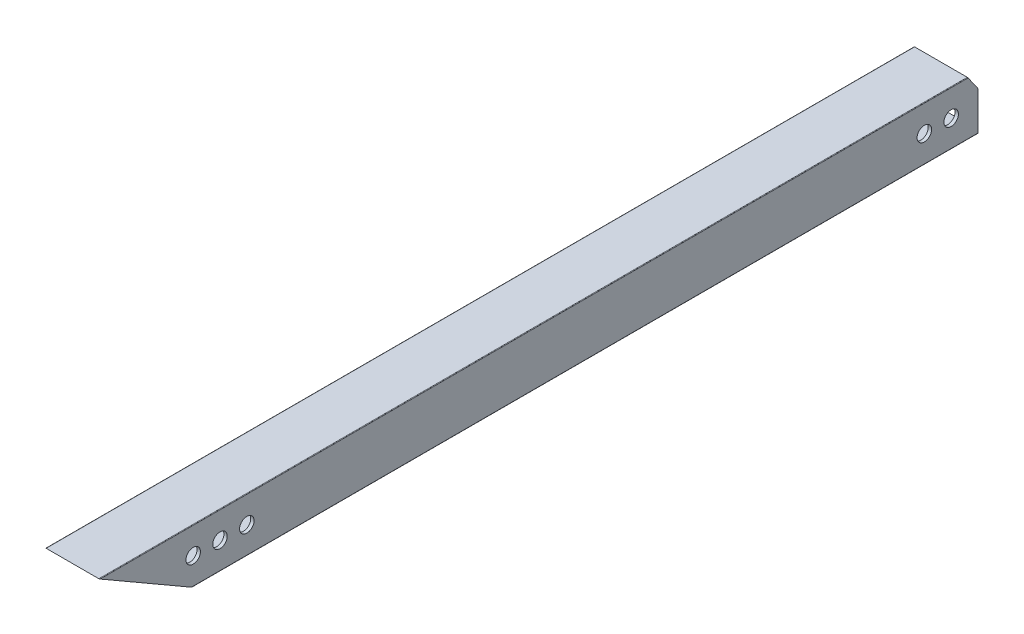
ISO-10303-21;
HEADER;
FILE_DESCRIPTION(('STEP AP214'),'2;1');
FILE_NAME('part.step','',(''),(''),'','','');
FILE_SCHEMA(('AUTOMOTIVE_DESIGN { 1 0 10303 214 1 1 1 1 }'));
ENDSEC;
DATA;
#1=APPLICATION_CONTEXT('core data for automotive mechanical design processes');
#2=APPLICATION_PROTOCOL_DEFINITION('international standard','automotive_design',2000,#1);
#3=PRODUCT_CONTEXT('',#1,'mechanical');
#4=PRODUCT('Part','Part','',(#3));
#5=PRODUCT_RELATED_PRODUCT_CATEGORY('part','',(#4));
#6=PRODUCT_DEFINITION_FORMATION('','',#4);
#7=PRODUCT_DEFINITION_CONTEXT('part definition',#1,'design');
#8=PRODUCT_DEFINITION('design','',#6,#7);
#9=PRODUCT_DEFINITION_SHAPE('','',#8);
#10=(LENGTH_UNIT() NAMED_UNIT(*) SI_UNIT(.MILLI.,.METRE.));
#11=(NAMED_UNIT(*) PLANE_ANGLE_UNIT() SI_UNIT($,.RADIAN.));
#12=(NAMED_UNIT(*) SI_UNIT($,.STERADIAN.) SOLID_ANGLE_UNIT());
#13=UNCERTAINTY_MEASURE_WITH_UNIT(LENGTH_MEASURE(1.E-05),#10,'distance_accuracy_value','');
#14=(GEOMETRIC_REPRESENTATION_CONTEXT(3) GLOBAL_UNCERTAINTY_ASSIGNED_CONTEXT((#13)) GLOBAL_UNIT_ASSIGNED_CONTEXT((#10,
#11,#12)) REPRESENTATION_CONTEXT('',''));
#15=CARTESIAN_POINT('',(0.,0.,0.));
#16=DIRECTION('',(0.,0.,1.));
#17=DIRECTION('',(1.,0.,0.));
#18=AXIS2_PLACEMENT_3D('',#15,#16,#17);
#19=CARTESIAN_POINT('',(-12.446,-12.446,0.));
#20=DIRECTION('',(0.,0.,-1.));
#21=DIRECTION('',(-1.,0.,0.));
#22=AXIS2_PLACEMENT_3D('',#19,#20,#21);
#23=PLANE('',#22);
#24=DIRECTION('',(-1.,0.,0.));
#25=VECTOR('',#24,1.);
#26=CARTESIAN_POINT('',(12.7,5.78069552987882,0.));
#27=LINE('',#26,#25);
#28=CARTESIAN_POINT('',(12.7,5.78069552987882,0.));
#29=VERTEX_POINT('',#28);
#30=CARTESIAN_POINT('',(11.1125,5.78069552987882,0.));
#31=VERTEX_POINT('',#30);
#32=EDGE_CURVE('E180',#29,#31,#27,.T.);
#33=ORIENTED_EDGE('',*,*,#32,.F.);
#34=DIRECTION('',(0.,1.,0.));
#35=VECTOR('',#34,1.);
#36=CARTESIAN_POINT('',(12.7,-12.446,0.));
#37=LINE('',#36,#35);
#38=CARTESIAN_POINT('',(12.7,-12.446,0.));
#39=VERTEX_POINT('',#38);
#40=EDGE_CURVE('E202',#39,#29,#37,.T.);
#41=ORIENTED_EDGE('',*,*,#40,.F.);
#42=CARTESIAN_POINT('',(12.446,-12.446,0.));
#43=DIRECTION('',(0.,0.,1.));
#44=DIRECTION('',(1.,0.,0.));
#45=AXIS2_PLACEMENT_3D('',#42,#43,#44);
#46=CIRCLE('',#45,0.254000000000001);
#47=CARTESIAN_POINT('',(12.446,-12.7,0.));
#48=VERTEX_POINT('',#47);
#49=EDGE_CURVE('E209',#48,#39,#46,.T.);
#50=ORIENTED_EDGE('',*,*,#49,.F.);
#51=DIRECTION('',(1.,0.,0.));
#52=VECTOR('',#51,1.);
#53=CARTESIAN_POINT('',(-12.446,-12.7,0.));
#54=LINE('',#53,#52);
#55=CARTESIAN_POINT('',(-12.446,-12.7,0.));
#56=VERTEX_POINT('',#55);
#57=EDGE_CURVE('E326',#56,#48,#54,.T.);
#58=ORIENTED_EDGE('',*,*,#57,.F.);
#59=CARTESIAN_POINT('',(-12.446,-12.446,0.));
#60=DIRECTION('',(0.,0.,1.));
#61=DIRECTION('',(-1.,0.,0.));
#62=AXIS2_PLACEMENT_3D('',#59,#60,#61);
#63=CIRCLE('',#62,0.254000000000001);
#64=CARTESIAN_POINT('',(-12.7,-12.446,0.));
#65=VERTEX_POINT('',#64);
#66=EDGE_CURVE('E199',#65,#56,#63,.T.);
#67=ORIENTED_EDGE('',*,*,#66,.F.);
#68=DIRECTION('',(0.,-1.,0.));
#69=VECTOR('',#68,1.);
#70=CARTESIAN_POINT('',(-12.7,-12.446,0.));
#71=LINE('',#70,#69);
#72=CARTESIAN_POINT('',(-12.7,5.78069552987882,0.));
#73=VERTEX_POINT('',#72);
#74=EDGE_CURVE('E188',#73,#65,#71,.T.);
#75=ORIENTED_EDGE('',*,*,#74,.F.);
#76=CARTESIAN_POINT('',(-11.1125,5.78069552987882,0.));
#77=VERTEX_POINT('',#76);
#78=EDGE_CURVE('E169',#77,#73,#27,.T.);
#79=ORIENTED_EDGE('',*,*,#78,.F.);
#80=DIRECTION('',(0.,-1.,0.));
#81=VECTOR('',#80,1.);
#82=CARTESIAN_POINT('',(-11.1125,-9.58849999999999,0.));
#83=LINE('',#82,#81);
#84=CARTESIAN_POINT('',(-11.1125,-9.58849999999999,0.));
#85=VERTEX_POINT('',#84);
#86=EDGE_CURVE('E293',#77,#85,#83,.T.);
#87=ORIENTED_EDGE('',*,*,#86,.T.);
#88=CARTESIAN_POINT('',(-9.5885,-9.5885,0.));
#89=DIRECTION('',(0.,0.,1.));
#90=DIRECTION('',(1.,0.,0.));
#91=AXIS2_PLACEMENT_3D('',#88,#89,#90);
#92=CIRCLE('',#91,1.524);
#93=CARTESIAN_POINT('',(-9.58849999999999,-11.1125,0.));
#94=VERTEX_POINT('',#93);
#95=EDGE_CURVE('E277',#85,#94,#92,.T.);
#96=ORIENTED_EDGE('',*,*,#95,.T.);
#97=DIRECTION('',(1.,0.,0.));
#98=VECTOR('',#97,1.);
#99=CARTESIAN_POINT('',(-9.58849999999999,-11.1125,0.));
#100=LINE('',#99,#98);
#101=CARTESIAN_POINT('',(9.58849999999999,-11.1125,0.));
#102=VERTEX_POINT('',#101);
#103=EDGE_CURVE('E281',#94,#102,#100,.T.);
#104=ORIENTED_EDGE('',*,*,#103,.T.);
#105=CARTESIAN_POINT('',(9.5885,-9.5885,0.));
#106=DIRECTION('',(0.,0.,1.));
#107=DIRECTION('',(-1.,0.,0.));
#108=AXIS2_PLACEMENT_3D('',#105,#106,#107);
#109=CIRCLE('',#108,1.524);
#110=CARTESIAN_POINT('',(11.1125,-9.58849999999999,0.));
#111=VERTEX_POINT('',#110);
#112=EDGE_CURVE('E285',#102,#111,#109,.T.);
#113=ORIENTED_EDGE('',*,*,#112,.T.);
#114=DIRECTION('',(0.,1.,0.));
#115=VECTOR('',#114,1.);
#116=CARTESIAN_POINT('',(11.1125,-9.58849999999999,0.));
#117=LINE('',#116,#115);
#118=EDGE_CURVE('E289',#111,#31,#117,.T.);
#119=ORIENTED_EDGE('',*,*,#118,.T.);
#120=EDGE_LOOP('',(#33,#41,#50,#58,#67,#75,#79,#87,#96,#104,#113,#119));
#121=FACE_BOUND('',#120,.T.);
#122=ADVANCED_FACE('F43',(#121),#23,.T.);
#123=CARTESIAN_POINT('',(-12.446,-12.446,415.925));
#124=DIRECTION('',(0.,0.,-1.));
#125=DIRECTION('',(-1.,0.,0.));
#126=AXIS2_PLACEMENT_3D('',#123,#124,#125);
#127=CYLINDRICAL_SURFACE('',#126,0.254000000000001);
#128=DIRECTION('',(0.,0.,-1.));
#129=VECTOR('',#128,1.);
#130=CARTESIAN_POINT('',(-12.446,-12.7,415.925));
#131=LINE('',#130,#129);
#132=CARTESIAN_POINT('',(-12.446,-12.7,371.930909487751));
#133=VERTEX_POINT('',#132);
#134=EDGE_CURVE('E235',#133,#56,#131,.T.);
#135=ORIENTED_EDGE('',*,*,#134,.F.);
#136=CARTESIAN_POINT('',(-12.446,-12.446,372.370850392873));
#137=DIRECTION('',(0.,0.866025403784438,-0.500000000000001));
#138=DIRECTION('',(0.,-0.500000000000001,-0.866025403784438));
#139=AXIS2_PLACEMENT_3D('',#136,#137,#138);
#140=ELLIPSE('',#139,0.508000000000001,0.254000000000001);
#141=CARTESIAN_POINT('',(-12.7,-12.446,372.370850392873));
#142=VERTEX_POINT('',#141);
#143=EDGE_CURVE('E244',#133,#142,#140,.T.);
#144=ORIENTED_EDGE('',*,*,#143,.T.);
#145=DIRECTION('',(0.,0.,-1.));
#146=VECTOR('',#145,1.);
#147=CARTESIAN_POINT('',(-12.7,-12.446,415.925));
#148=LINE('',#147,#146);
#149=EDGE_CURVE('E206',#142,#65,#148,.T.);
#150=ORIENTED_EDGE('',*,*,#149,.T.);
#151=ORIENTED_EDGE('',*,*,#66,.T.);
#152=EDGE_LOOP('',(#135,#144,#150,#151));
#153=FACE_BOUND('',#152,.T.);
#154=ADVANCED_FACE('F45',(#153),#127,.T.);
#155=CARTESIAN_POINT('',(-12.446,-12.7,415.925));
#156=DIRECTION('',(0.,1.,0.));
#157=DIRECTION('',(0.,0.,1.));
#158=AXIS2_PLACEMENT_3D('',#155,#156,#157);
#159=PLANE('',#158);
#160=DIRECTION('',(0.,0.,-1.));
#161=VECTOR('',#160,1.);
#162=CARTESIAN_POINT('',(12.446,-12.7,415.925));
#163=LINE('',#162,#161);
#164=CARTESIAN_POINT('',(12.446,-12.7,371.930909487751));
#165=VERTEX_POINT('',#164);
#166=EDGE_CURVE('E232',#165,#48,#163,.T.);
#167=ORIENTED_EDGE('',*,*,#166,.F.);
#168=DIRECTION('',(-1.,0.,0.));
#169=VECTOR('',#168,1.);
#170=CARTESIAN_POINT('',(12.7,-12.7,371.930909487751));
#171=LINE('',#170,#169);
#172=EDGE_CURVE('E346',#165,#133,#171,.T.);
#173=ORIENTED_EDGE('',*,*,#172,.T.);
#174=ORIENTED_EDGE('',*,*,#134,.T.);
#175=ORIENTED_EDGE('',*,*,#57,.T.);
#176=EDGE_LOOP('',(#167,#173,#174,#175));
#177=FACE_BOUND('',#176,.T.);
#178=ADVANCED_FACE('F492',(#177),#159,.F.);
#179=CARTESIAN_POINT('',(12.446,-12.446,415.925));
#180=DIRECTION('',(0.,0.,-1.));
#181=DIRECTION('',(-1.,0.,0.));
#182=AXIS2_PLACEMENT_3D('',#179,#180,#181);
#183=CYLINDRICAL_SURFACE('',#182,0.254000000000001);
#184=DIRECTION('',(0.,0.,-1.));
#185=VECTOR('',#184,1.);
#186=CARTESIAN_POINT('',(12.7,-12.446,415.925));
#187=LINE('',#186,#185);
#188=CARTESIAN_POINT('',(12.7,-12.446,372.370850392873));
#189=VERTEX_POINT('',#188);
#190=EDGE_CURVE('E229',#189,#39,#187,.T.);
#191=ORIENTED_EDGE('',*,*,#190,.F.);
#192=CARTESIAN_POINT('',(12.446,-12.446,372.370850392873));
#193=DIRECTION('',(0.,0.866025403784438,-0.500000000000001));
#194=DIRECTION('',(0.,-0.500000000000001,-0.866025403784438));
#195=AXIS2_PLACEMENT_3D('',#192,#193,#194);
#196=ELLIPSE('',#195,0.508000000000001,0.254000000000001);
#197=EDGE_CURVE('E383',#189,#165,#196,.T.);
#198=ORIENTED_EDGE('',*,*,#197,.T.);
#199=ORIENTED_EDGE('',*,*,#166,.T.);
#200=ORIENTED_EDGE('',*,*,#49,.T.);
#201=EDGE_LOOP('',(#191,#198,#199,#200));
#202=FACE_BOUND('',#201,.T.);
#203=ADVANCED_FACE('F335',(#202),#183,.T.);
#204=CARTESIAN_POINT('',(12.7,-12.446,415.925));
#205=DIRECTION('',(-1.,0.,0.));
#206=DIRECTION('',(0.,0.,1.));
#207=AXIS2_PLACEMENT_3D('',#204,#205,#206);
#208=PLANE('',#207);
#209=CARTESIAN_POINT('',(12.7,0.,371.475));
#210=DIRECTION('',(-1.,0.,0.));
#211=DIRECTION('',(0.,0.,1.));
#212=AXIS2_PLACEMENT_3D('',#209,#210,#211);
#213=CIRCLE('',#212,3.429);
#214=CARTESIAN_POINT('',(12.7,0.,374.904));
#215=VERTEX_POINT('',#214);
#216=EDGE_CURVE('E435',#215,#215,#213,.T.);
#217=ORIENTED_EDGE('',*,*,#216,.T.);
#218=EDGE_LOOP('',(#217));
#219=FACE_BOUND('',#218,.T.);
#220=CARTESIAN_POINT('',(12.7,0.,358.775));
#221=DIRECTION('',(-1.,0.,0.));
#222=DIRECTION('',(0.,0.,1.));
#223=AXIS2_PLACEMENT_3D('',#220,#221,#222);
#224=CIRCLE('',#223,3.429);
#225=CARTESIAN_POINT('',(12.7,0.,362.204));
#226=VERTEX_POINT('',#225);
#227=EDGE_CURVE('E443',#226,#226,#224,.T.);
#228=ORIENTED_EDGE('',*,*,#227,.T.);
#229=EDGE_LOOP('',(#228));
#230=FACE_BOUND('',#229,.T.);
#231=CARTESIAN_POINT('',(12.7,-1.82571422441161E-13,346.075));
#232=DIRECTION('',(-1.,0.,0.));
#233=DIRECTION('',(0.,0.,1.));
#234=AXIS2_PLACEMENT_3D('',#231,#232,#233);
#235=CIRCLE('',#234,3.429);
#236=CARTESIAN_POINT('',(12.7,-1.82571422441161E-13,349.504));
#237=VERTEX_POINT('',#236);
#238=EDGE_CURVE('E451',#237,#237,#235,.T.);
#239=ORIENTED_EDGE('',*,*,#238,.T.);
#240=EDGE_LOOP('',(#239));
#241=FACE_BOUND('',#240,.T.);
#242=CARTESIAN_POINT('',(12.7,0.,12.7));
#243=DIRECTION('',(-1.,0.,0.));
#244=DIRECTION('',(0.,0.,1.));
#245=AXIS2_PLACEMENT_3D('',#242,#243,#244);
#246=CIRCLE('',#245,3.429);
#247=CARTESIAN_POINT('',(12.7,0.,16.129));
#248=VERTEX_POINT('',#247);
#249=EDGE_CURVE('E193',#248,#248,#246,.T.);
#250=ORIENTED_EDGE('',*,*,#249,.T.);
#251=EDGE_LOOP('',(#250));
#252=FACE_BOUND('',#251,.T.);
#253=CARTESIAN_POINT('',(12.7,0.,25.4));
#254=DIRECTION('',(-1.,0.,0.));
#255=DIRECTION('',(0.,0.,1.));
#256=AXIS2_PLACEMENT_3D('',#253,#254,#255);
#257=CIRCLE('',#256,3.429);
#258=CARTESIAN_POINT('',(12.7,0.,28.829));
#259=VERTEX_POINT('',#258);
#260=EDGE_CURVE('E424',#259,#259,#257,.T.);
#261=ORIENTED_EDGE('',*,*,#260,.T.);
#262=EDGE_LOOP('',(#261));
#263=FACE_BOUND('',#262,.T.);
#264=ORIENTED_EDGE('',*,*,#40,.T.);
#265=DIRECTION('',(0.,0.819152044288984,0.573576436351057));
#266=VECTOR('',#265,1.);
#267=CARTESIAN_POINT('',(12.7,5.78069552987882,0.));
#268=LINE('',#267,#266);
#269=CARTESIAN_POINT('',(12.7,12.4460000000001,4.66709643444197));
#270=VERTEX_POINT('',#269);
#271=EDGE_CURVE('E194',#29,#270,#268,.T.);
#272=ORIENTED_EDGE('',*,*,#271,.T.);
#273=DIRECTION('',(0.,0.,-1.));
#274=VECTOR('',#273,1.);
#275=CARTESIAN_POINT('',(12.7,12.446,415.925));
#276=LINE('',#275,#274);
#277=CARTESIAN_POINT('',(12.7,12.446,415.485059094877));
#278=VERTEX_POINT('',#277);
#279=EDGE_CURVE('E225',#278,#270,#276,.T.);
#280=ORIENTED_EDGE('',*,*,#279,.F.);
#281=DIRECTION('',(0.,-0.500000000000001,-0.866025403784438));
#282=VECTOR('',#281,1.);
#283=CARTESIAN_POINT('',(12.7,12.7,415.925));
#284=LINE('',#283,#282);
#285=EDGE_CURVE('E343',#278,#189,#284,.T.);
#286=ORIENTED_EDGE('',*,*,#285,.T.);
#287=ORIENTED_EDGE('',*,*,#190,.T.);
#288=EDGE_LOOP('',(#264,#272,#280,#286,#287));
#289=FACE_BOUND('',#288,.T.);
#290=ADVANCED_FACE('F340',(#219,#230,#241,#252,#263,#289),#208,.F.);
#291=CARTESIAN_POINT('',(12.446,12.446,415.925));
#292=DIRECTION('',(0.,0.,-1.));
#293=DIRECTION('',(-1.,0.,0.));
#294=AXIS2_PLACEMENT_3D('',#291,#292,#293);
#295=CYLINDRICAL_SURFACE('',#294,0.254000000000001);
#296=ORIENTED_EDGE('',*,*,#279,.T.);
#297=CARTESIAN_POINT('',(12.446,12.446,4.66709643444185));
#298=DIRECTION('',(0.,-0.573576436351057,0.819152044288984));
#299=DIRECTION('',(0.,-0.819152044288984,-0.573576436351057));
#300=AXIS2_PLACEMENT_3D('',#297,#298,#299);
#301=ELLIPSE('',#300,0.310076745545414,0.254000000000001);
#302=CARTESIAN_POINT('',(12.446,12.7,4.84494914914713));
#303=VERTEX_POINT('',#302);
#304=EDGE_CURVE('E251',#270,#303,#301,.T.);
#305=ORIENTED_EDGE('',*,*,#304,.T.);
#306=DIRECTION('',(0.,0.,-1.));
#307=VECTOR('',#306,1.);
#308=CARTESIAN_POINT('',(12.446,12.7,415.925));
#309=LINE('',#308,#307);
#310=CARTESIAN_POINT('',(12.446,12.7,415.925));
#311=VERTEX_POINT('',#310);
#312=EDGE_CURVE('E221',#311,#303,#309,.T.);
#313=ORIENTED_EDGE('',*,*,#312,.F.);
#314=CARTESIAN_POINT('',(12.446,12.446,415.485059094877));
#315=DIRECTION('',(0.,0.866025403784438,-0.500000000000001));
#316=DIRECTION('',(0.,-0.500000000000001,-0.866025403784438));
#317=AXIS2_PLACEMENT_3D('',#314,#315,#316);
#318=ELLIPSE('',#317,0.508000000000001,0.254000000000001);
#319=EDGE_CURVE('E380',#311,#278,#318,.T.);
#320=ORIENTED_EDGE('',*,*,#319,.T.);
#321=EDGE_LOOP('',(#296,#305,#313,#320));
#322=FACE_BOUND('',#321,.T.);
#323=ADVANCED_FACE('F410',(#322),#295,.T.);
#324=CARTESIAN_POINT('',(-12.446,12.7,415.925));
#325=DIRECTION('',(0.,-1.,0.));
#326=DIRECTION('',(0.,0.,-1.));
#327=AXIS2_PLACEMENT_3D('',#324,#325,#326);
#328=PLANE('',#327);
#329=ORIENTED_EDGE('',*,*,#312,.T.);
#330=DIRECTION('',(-1.,0.,0.));
#331=VECTOR('',#330,1.);
#332=CARTESIAN_POINT('',(12.7,12.7,4.84494914914713));
#333=LINE('',#332,#331);
#334=CARTESIAN_POINT('',(-12.446,12.7,4.84494914914712));
#335=VERTEX_POINT('',#334);
#336=EDGE_CURVE('E181',#303,#335,#333,.T.);
#337=ORIENTED_EDGE('',*,*,#336,.T.);
#338=DIRECTION('',(0.,0.,-1.));
#339=VECTOR('',#338,1.);
#340=CARTESIAN_POINT('',(-12.446,12.7,415.925));
#341=LINE('',#340,#339);
#342=CARTESIAN_POINT('',(-12.446,12.7,415.925));
#343=VERTEX_POINT('',#342);
#344=EDGE_CURVE('E217',#343,#335,#341,.T.);
#345=ORIENTED_EDGE('',*,*,#344,.F.);
#346=DIRECTION('',(-1.,0.,0.));
#347=VECTOR('',#346,1.);
#348=CARTESIAN_POINT('',(-12.446,12.7,415.925));
#349=LINE('',#348,#347);
#350=EDGE_CURVE('E201',#311,#343,#349,.T.);
#351=ORIENTED_EDGE('',*,*,#350,.F.);
#352=EDGE_LOOP('',(#329,#337,#345,#351));
#353=FACE_BOUND('',#352,.T.);
#354=ADVANCED_FACE('F414',(#353),#328,.F.);
#355=CARTESIAN_POINT('',(-12.446,12.446,415.925));
#356=DIRECTION('',(0.,0.,-1.));
#357=DIRECTION('',(-1.,0.,0.));
#358=AXIS2_PLACEMENT_3D('',#355,#356,#357);
#359=CYLINDRICAL_SURFACE('',#358,0.254000000000001);
#360=ORIENTED_EDGE('',*,*,#344,.T.);
#361=CARTESIAN_POINT('',(-12.446,12.446,4.66709643444185));
#362=DIRECTION('',(0.,-0.573576436351057,0.819152044288984));
#363=DIRECTION('',(0.,-0.819152044288984,-0.573576436351057));
#364=AXIS2_PLACEMENT_3D('',#361,#362,#363);
#365=ELLIPSE('',#364,0.310076745545414,0.254000000000001);
#366=CARTESIAN_POINT('',(-12.7,12.446,4.66709643444187));
#367=VERTEX_POINT('',#366);
#368=EDGE_CURVE('E404',#335,#367,#365,.T.);
#369=ORIENTED_EDGE('',*,*,#368,.T.);
#370=DIRECTION('',(0.,0.,-1.));
#371=VECTOR('',#370,1.);
#372=CARTESIAN_POINT('',(-12.7,12.446,415.925));
#373=LINE('',#372,#371);
#374=CARTESIAN_POINT('',(-12.7,12.446,415.485059094877));
#375=VERTEX_POINT('',#374);
#376=EDGE_CURVE('E191',#375,#367,#373,.T.);
#377=ORIENTED_EDGE('',*,*,#376,.F.);
#378=CARTESIAN_POINT('',(-12.446,12.446,415.485059094877));
#379=DIRECTION('',(0.,0.866025403784438,-0.500000000000001));
#380=DIRECTION('',(0.,-0.500000000000001,-0.866025403784438));
#381=AXIS2_PLACEMENT_3D('',#378,#379,#380);
#382=ELLIPSE('',#381,0.508000000000001,0.254000000000001);
#383=EDGE_CURVE('E61',#375,#343,#382,.T.);
#384=ORIENTED_EDGE('',*,*,#383,.T.);
#385=EDGE_LOOP('',(#360,#369,#377,#384));
#386=FACE_BOUND('',#385,.T.);
#387=ADVANCED_FACE('F418',(#386),#359,.T.);
#388=CARTESIAN_POINT('',(-12.7,-12.446,415.925));
#389=DIRECTION('',(1.,0.,0.));
#390=DIRECTION('',(0.,0.,-1.));
#391=AXIS2_PLACEMENT_3D('',#388,#389,#390);
#392=PLANE('',#391);
#393=CARTESIAN_POINT('',(-12.7,0.,371.475));
#394=DIRECTION('',(-1.,0.,0.));
#395=DIRECTION('',(0.,0.,1.));
#396=AXIS2_PLACEMENT_3D('',#393,#394,#395);
#397=CIRCLE('',#396,3.429);
#398=CARTESIAN_POINT('',(-12.7,0.,374.904));
#399=VERTEX_POINT('',#398);
#400=EDGE_CURVE('E354',#399,#399,#397,.T.);
#401=ORIENTED_EDGE('',*,*,#400,.F.);
#402=EDGE_LOOP('',(#401));
#403=FACE_BOUND('',#402,.T.);
#404=CARTESIAN_POINT('',(-12.7,0.,358.775));
#405=DIRECTION('',(-1.,0.,0.));
#406=DIRECTION('',(0.,0.,1.));
#407=AXIS2_PLACEMENT_3D('',#404,#405,#406);
#408=CIRCLE('',#407,3.429);
#409=CARTESIAN_POINT('',(-12.7,0.,362.204));
#410=VERTEX_POINT('',#409);
#411=EDGE_CURVE('E439',#410,#410,#408,.T.);
#412=ORIENTED_EDGE('',*,*,#411,.F.);
#413=EDGE_LOOP('',(#412));
#414=FACE_BOUND('',#413,.T.);
#415=CARTESIAN_POINT('',(-12.7,-1.82571422441161E-13,346.075));
#416=DIRECTION('',(-1.,0.,0.));
#417=DIRECTION('',(0.,0.,1.));
#418=AXIS2_PLACEMENT_3D('',#415,#416,#417);
#419=CIRCLE('',#418,3.429);
#420=CARTESIAN_POINT('',(-12.7,-1.82571422441161E-13,349.504));
#421=VERTEX_POINT('',#420);
#422=EDGE_CURVE('E447',#421,#421,#419,.T.);
#423=ORIENTED_EDGE('',*,*,#422,.F.);
#424=EDGE_LOOP('',(#423));
#425=FACE_BOUND('',#424,.T.);
#426=CARTESIAN_POINT('',(-12.7,0.,12.7));
#427=DIRECTION('',(-1.,0.,0.));
#428=DIRECTION('',(0.,0.,1.));
#429=AXIS2_PLACEMENT_3D('',#426,#427,#428);
#430=CIRCLE('',#429,3.429);
#431=CARTESIAN_POINT('',(-12.7,0.,16.129));
#432=VERTEX_POINT('',#431);
#433=EDGE_CURVE('E454',#432,#432,#430,.T.);
#434=ORIENTED_EDGE('',*,*,#433,.F.);
#435=EDGE_LOOP('',(#434));
#436=FACE_BOUND('',#435,.T.);
#437=CARTESIAN_POINT('',(-12.7,0.,25.4));
#438=DIRECTION('',(-1.,0.,0.));
#439=DIRECTION('',(0.,0.,1.));
#440=AXIS2_PLACEMENT_3D('',#437,#438,#439);
#441=CIRCLE('',#440,3.429);
#442=CARTESIAN_POINT('',(-12.7,0.,28.829));
#443=VERTEX_POINT('',#442);
#444=EDGE_CURVE('E420',#443,#443,#441,.T.);
#445=ORIENTED_EDGE('',*,*,#444,.F.);
#446=EDGE_LOOP('',(#445));
#447=FACE_BOUND('',#446,.T.);
#448=ORIENTED_EDGE('',*,*,#376,.T.);
#449=DIRECTION('',(0.,0.819152044288984,0.573576436351057));
#450=VECTOR('',#449,1.);
#451=CARTESIAN_POINT('',(-12.7,5.78069552987882,0.));
#452=LINE('',#451,#450);
#453=EDGE_CURVE('E172',#73,#367,#452,.T.);
#454=ORIENTED_EDGE('',*,*,#453,.F.);
#455=ORIENTED_EDGE('',*,*,#74,.T.);
#456=ORIENTED_EDGE('',*,*,#149,.F.);
#457=DIRECTION('',(0.,-0.500000000000001,-0.866025403784438));
#458=VECTOR('',#457,1.);
#459=CARTESIAN_POINT('',(-12.7,12.7,415.925));
#460=LINE('',#459,#458);
#461=EDGE_CURVE('E347',#375,#142,#460,.T.);
#462=ORIENTED_EDGE('',*,*,#461,.F.);
#463=EDGE_LOOP('',(#448,#454,#455,#456,#462));
#464=FACE_BOUND('',#463,.T.);
#465=ADVANCED_FACE('F186',(#403,#414,#425,#436,#447,#464),#392,.F.);
#466=CARTESIAN_POINT('',(-9.5885,-9.5885,415.925));
#467=DIRECTION('',(0.,0.,-1.));
#468=DIRECTION('',(-1.,0.,0.));
#469=AXIS2_PLACEMENT_3D('',#466,#467,#468);
#470=CYLINDRICAL_SURFACE('',#469,1.524);
#471=CARTESIAN_POINT('',(-9.5885,-9.5885,377.320185575501));
#472=DIRECTION('',(0.,0.866025403784438,-0.500000000000001));
#473=DIRECTION('',(0.,-0.500000000000001,-0.866025403784438));
#474=AXIS2_PLACEMENT_3D('',#471,#472,#473);
#475=ELLIPSE('',#474,3.04799999999999,1.524);
#476=CARTESIAN_POINT('',(-9.58849999999999,-11.1125,374.680540144766));
#477=VERTEX_POINT('',#476);
#478=CARTESIAN_POINT('',(-11.1125,-9.58849999999999,377.320185575501));
#479=VERTEX_POINT('',#478);
#480=EDGE_CURVE('E69',#477,#479,#475,.T.);
#481=ORIENTED_EDGE('',*,*,#480,.F.);
#482=DIRECTION('',(0.,0.,-1.));
#483=VECTOR('',#482,1.);
#484=CARTESIAN_POINT('',(-9.58849999999999,-11.1125,415.925));
#485=LINE('',#484,#483);
#486=EDGE_CURVE('E321',#477,#94,#485,.T.);
#487=ORIENTED_EDGE('',*,*,#486,.T.);
#488=ORIENTED_EDGE('',*,*,#95,.F.);
#489=DIRECTION('',(0.,0.,-1.));
#490=VECTOR('',#489,1.);
#491=CARTESIAN_POINT('',(-11.1125,-9.58849999999999,415.925));
#492=LINE('',#491,#490);
#493=EDGE_CURVE('E296',#479,#85,#492,.T.);
#494=ORIENTED_EDGE('',*,*,#493,.F.);
#495=EDGE_LOOP('',(#481,#487,#488,#494));
#496=FACE_BOUND('',#495,.T.);
#497=ADVANCED_FACE('F496',(#496),#470,.F.);
#498=CARTESIAN_POINT('',(-9.58849999999999,-11.1125,415.925));
#499=DIRECTION('',(0.,1.,0.));
#500=DIRECTION('',(0.,0.,1.));
#501=AXIS2_PLACEMENT_3D('',#498,#499,#500);
#502=PLANE('',#501);
#503=DIRECTION('',(-1.,0.,0.));
#504=VECTOR('',#503,1.);
#505=CARTESIAN_POINT('',(-9.58849999999999,-11.1125,374.680540144766));
#506=LINE('',#505,#504);
#507=CARTESIAN_POINT('',(9.58849999999999,-11.1125,374.680540144766));
#508=VERTEX_POINT('',#507);
#509=EDGE_CURVE('E373',#508,#477,#506,.T.);
#510=ORIENTED_EDGE('',*,*,#509,.F.);
#511=DIRECTION('',(0.,0.,-1.));
#512=VECTOR('',#511,1.);
#513=CARTESIAN_POINT('',(9.58849999999999,-11.1125,415.925));
#514=LINE('',#513,#512);
#515=EDGE_CURVE('E318',#508,#102,#514,.T.);
#516=ORIENTED_EDGE('',*,*,#515,.T.);
#517=ORIENTED_EDGE('',*,*,#103,.F.);
#518=ORIENTED_EDGE('',*,*,#486,.F.);
#519=EDGE_LOOP('',(#510,#516,#517,#518));
#520=FACE_BOUND('',#519,.T.);
#521=ADVANCED_FACE('F548',(#520),#502,.T.);
#522=CARTESIAN_POINT('',(9.5885,-9.5885,415.925));
#523=DIRECTION('',(0.,0.,-1.));
#524=DIRECTION('',(-1.,0.,0.));
#525=AXIS2_PLACEMENT_3D('',#522,#523,#524);
#526=CYLINDRICAL_SURFACE('',#525,1.524);
#527=CARTESIAN_POINT('',(9.5885,-9.5885,377.320185575501));
#528=DIRECTION('',(0.,0.866025403784438,-0.500000000000001));
#529=DIRECTION('',(0.,-0.500000000000001,-0.866025403784438));
#530=AXIS2_PLACEMENT_3D('',#527,#528,#529);
#531=ELLIPSE('',#530,3.04799999999999,1.524);
#532=CARTESIAN_POINT('',(11.1125,-9.58849999999998,377.320185575501));
#533=VERTEX_POINT('',#532);
#534=EDGE_CURVE('E370',#533,#508,#531,.T.);
#535=ORIENTED_EDGE('',*,*,#534,.F.);
#536=DIRECTION('',(0.,0.,-1.));
#537=VECTOR('',#536,1.);
#538=CARTESIAN_POINT('',(11.1125,-9.58849999999999,415.925));
#539=LINE('',#538,#537);
#540=EDGE_CURVE('E315',#533,#111,#539,.T.);
#541=ORIENTED_EDGE('',*,*,#540,.T.);
#542=ORIENTED_EDGE('',*,*,#112,.F.);
#543=ORIENTED_EDGE('',*,*,#515,.F.);
#544=EDGE_LOOP('',(#535,#541,#542,#543));
#545=FACE_BOUND('',#544,.T.);
#546=ADVANCED_FACE('F555',(#545),#526,.F.);
#547=CARTESIAN_POINT('',(11.1125,-9.58849999999999,415.925));
#548=DIRECTION('',(-1.,0.,0.));
#549=DIRECTION('',(0.,-1.,0.));
#550=AXIS2_PLACEMENT_3D('',#547,#548,#549);
#551=PLANE('',#550);
#552=CARTESIAN_POINT('',(11.1125,0.,371.475));
#553=DIRECTION('',(-1.,0.,0.));
#554=DIRECTION('',(0.,-1.,0.));
#555=AXIS2_PLACEMENT_3D('',#552,#553,#554);
#556=CIRCLE('',#555,3.429);
#557=CARTESIAN_POINT('',(11.1125,-3.42900000000001,371.475));
#558=VERTEX_POINT('',#557);
#559=EDGE_CURVE('E273',#558,#558,#556,.T.);
#560=ORIENTED_EDGE('',*,*,#559,.F.);
#561=EDGE_LOOP('',(#560));
#562=FACE_BOUND('',#561,.T.);
#563=CARTESIAN_POINT('',(11.1125,0.,358.775));
#564=DIRECTION('',(-1.,0.,0.));
#565=DIRECTION('',(0.,-1.,0.));
#566=AXIS2_PLACEMENT_3D('',#563,#564,#565);
#567=CIRCLE('',#566,3.429);
#568=CARTESIAN_POINT('',(11.1125,-3.42900000000009,358.775));
#569=VERTEX_POINT('',#568);
#570=EDGE_CURVE('E259',#569,#569,#567,.T.);
#571=ORIENTED_EDGE('',*,*,#570,.F.);
#572=EDGE_LOOP('',(#571));
#573=FACE_BOUND('',#572,.T.);
#574=CARTESIAN_POINT('',(11.1125,-1.82571422441161E-13,346.075));
#575=DIRECTION('',(-1.,0.,0.));
#576=DIRECTION('',(0.,-1.,0.));
#577=AXIS2_PLACEMENT_3D('',#574,#575,#576);
#578=CIRCLE('',#577,3.429);
#579=CARTESIAN_POINT('',(11.1125,-3.42900000000018,346.075));
#580=VERTEX_POINT('',#579);
#581=EDGE_CURVE('E255',#580,#580,#578,.T.);
#582=ORIENTED_EDGE('',*,*,#581,.F.);
#583=EDGE_LOOP('',(#582));
#584=FACE_BOUND('',#583,.T.);
#585=CARTESIAN_POINT('',(11.1125,0.,12.7));
#586=DIRECTION('',(-1.,0.,0.));
#587=DIRECTION('',(0.,-1.,0.));
#588=AXIS2_PLACEMENT_3D('',#585,#586,#587);
#589=CIRCLE('',#588,3.429);
#590=CARTESIAN_POINT('',(11.1125,-3.42900000000005,12.7));
#591=VERTEX_POINT('',#590);
#592=EDGE_CURVE('E250',#591,#591,#589,.T.);
#593=ORIENTED_EDGE('',*,*,#592,.F.);
#594=EDGE_LOOP('',(#593));
#595=FACE_BOUND('',#594,.T.);
#596=DIRECTION('',(0.,0.819152044288984,0.573576436351057));
#597=VECTOR('',#596,1.);
#598=CARTESIAN_POINT('',(11.1125,190.888637186166,129.613976130219));
#599=LINE('',#598,#597);
#600=CARTESIAN_POINT('',(11.1125,9.58849999999999,2.6662533940075));
#601=VERTEX_POINT('',#600);
#602=EDGE_CURVE('E401',#31,#601,#599,.T.);
#603=ORIENTED_EDGE('',*,*,#602,.F.);
#604=ORIENTED_EDGE('',*,*,#118,.F.);
#605=ORIENTED_EDGE('',*,*,#540,.F.);
#606=DIRECTION('',(0.,-0.500000000000001,-0.866025403784438));
#607=VECTOR('',#606,1.);
#608=CARTESIAN_POINT('',(11.1125,7.12787499999998,406.273796393875));
#609=LINE('',#608,#607);
#610=CARTESIAN_POINT('',(11.1125,9.58849999999999,410.535723912249));
#611=VERTEX_POINT('',#610);
#612=EDGE_CURVE('E367',#611,#533,#609,.T.);
#613=ORIENTED_EDGE('',*,*,#612,.F.);
#614=DIRECTION('',(0.,0.,-1.));
#615=VECTOR('',#614,1.);
#616=CARTESIAN_POINT('',(11.1125,9.58849999999999,415.925));
#617=LINE('',#616,#615);
#618=EDGE_CURVE('E311',#611,#601,#617,.T.);
#619=ORIENTED_EDGE('',*,*,#618,.T.);
#620=EDGE_LOOP('',(#603,#604,#605,#613,#619));
#621=FACE_BOUND('',#620,.T.);
#622=CARTESIAN_POINT('',(11.1125,0.,25.4));
#623=DIRECTION('',(-1.,0.,0.));
#624=DIRECTION('',(0.,-1.,0.));
#625=AXIS2_PLACEMENT_3D('',#622,#623,#624);
#626=CIRCLE('',#625,3.429);
#627=CARTESIAN_POINT('',(11.1125,-3.42900000000005,25.4));
#628=VERTEX_POINT('',#627);
#629=EDGE_CURVE('E243',#628,#628,#626,.T.);
#630=ORIENTED_EDGE('',*,*,#629,.F.);
#631=EDGE_LOOP('',(#630));
#632=FACE_BOUND('',#631,.T.);
#633=ADVANCED_FACE('F562',(#562,#573,#584,#595,#621,#632),#551,.T.);
#634=CARTESIAN_POINT('',(9.5885,9.5885,415.925));
#635=DIRECTION('',(0.,0.,-1.));
#636=DIRECTION('',(-1.,0.,0.));
#637=AXIS2_PLACEMENT_3D('',#634,#635,#636);
#638=CYLINDRICAL_SURFACE('',#637,1.524);
#639=CARTESIAN_POINT('',(9.5885,9.5885,2.6662533940075));
#640=DIRECTION('',(0.,-0.573576436351057,0.819152044288984));
#641=DIRECTION('',(0.,-0.819152044288984,-0.573576436351057));
#642=AXIS2_PLACEMENT_3D('',#639,#640,#641);
#643=ELLIPSE('',#642,1.86046047327248,1.524);
#644=CARTESIAN_POINT('',(9.58849999999999,11.1125,3.73336968223914));
#645=VERTEX_POINT('',#644);
#646=EDGE_CURVE('E398',#601,#645,#643,.T.);
#647=ORIENTED_EDGE('',*,*,#646,.F.);
#648=ORIENTED_EDGE('',*,*,#618,.F.);
#649=CARTESIAN_POINT('',(9.5885,9.5885,410.535723912249));
#650=DIRECTION('',(0.,0.866025403784438,-0.500000000000001));
#651=DIRECTION('',(0.,-0.500000000000001,-0.866025403784438));
#652=AXIS2_PLACEMENT_3D('',#649,#650,#651);
#653=ELLIPSE('',#652,3.04799999999999,1.524);
#654=CARTESIAN_POINT('',(9.58849999999999,11.1125,413.175369342984));
#655=VERTEX_POINT('',#654);
#656=EDGE_CURVE('E364',#655,#611,#653,.T.);
#657=ORIENTED_EDGE('',*,*,#656,.F.);
#658=DIRECTION('',(0.,0.,-1.));
#659=VECTOR('',#658,1.);
#660=CARTESIAN_POINT('',(9.58849999999999,11.1125,415.925));
#661=LINE('',#660,#659);
#662=EDGE_CURVE('E307',#655,#645,#661,.T.);
#663=ORIENTED_EDGE('',*,*,#662,.T.);
#664=EDGE_LOOP('',(#647,#648,#657,#663));
#665=FACE_BOUND('',#664,.T.);
#666=ADVANCED_FACE('F570',(#665),#638,.F.);
#667=CARTESIAN_POINT('',(-9.58849999999999,11.1125,415.925));
#668=DIRECTION('',(0.,-1.,0.));
#669=DIRECTION('',(1.,0.,0.));
#670=AXIS2_PLACEMENT_3D('',#667,#668,#669);
#671=PLANE('',#670);
#672=DIRECTION('',(-1.,0.,0.));
#673=VECTOR('',#672,1.);
#674=CARTESIAN_POINT('',(-9.58849999999996,11.1125,3.73336968223914));
#675=LINE('',#674,#673);
#676=CARTESIAN_POINT('',(-9.58849999999999,11.1125,3.73336968223914));
#677=VERTEX_POINT('',#676);
#678=EDGE_CURVE('E395',#645,#677,#675,.T.);
#679=ORIENTED_EDGE('',*,*,#678,.F.);
#680=ORIENTED_EDGE('',*,*,#662,.F.);
#681=DIRECTION('',(1.,0.,0.));
#682=VECTOR('',#681,1.);
#683=CARTESIAN_POINT('',(-9.58849999999999,11.1125,413.175369342984));
#684=LINE('',#683,#682);
#685=CARTESIAN_POINT('',(-9.58849999999999,11.1125,413.175369342984));
#686=VERTEX_POINT('',#685);
#687=EDGE_CURVE('E361',#686,#655,#684,.T.);
#688=ORIENTED_EDGE('',*,*,#687,.F.);
#689=DIRECTION('',(0.,0.,-1.));
#690=VECTOR('',#689,1.);
#691=CARTESIAN_POINT('',(-9.58849999999999,11.1125,415.925));
#692=LINE('',#691,#690);
#693=EDGE_CURVE('E303',#686,#677,#692,.T.);
#694=ORIENTED_EDGE('',*,*,#693,.T.);
#695=EDGE_LOOP('',(#679,#680,#688,#694));
#696=FACE_BOUND('',#695,.T.);
#697=ADVANCED_FACE('F578',(#696),#671,.T.);
#698=CARTESIAN_POINT('',(-9.5885,9.5885,415.925));
#699=DIRECTION('',(0.,0.,-1.));
#700=DIRECTION('',(-1.,0.,0.));
#701=AXIS2_PLACEMENT_3D('',#698,#699,#700);
#702=CYLINDRICAL_SURFACE('',#701,1.524);
#703=CARTESIAN_POINT('',(-9.5885,9.5885,2.6662533940075));
#704=DIRECTION('',(0.,-0.573576436351057,0.819152044288984));
#705=DIRECTION('',(0.,-0.819152044288984,-0.573576436351057));
#706=AXIS2_PLACEMENT_3D('',#703,#704,#705);
#707=ELLIPSE('',#706,1.86046047327248,1.524);
#708=CARTESIAN_POINT('',(-11.1125,9.58849999999999,2.66625339400767));
#709=VERTEX_POINT('',#708);
#710=EDGE_CURVE('E392',#677,#709,#707,.T.);
#711=ORIENTED_EDGE('',*,*,#710,.F.);
#712=ORIENTED_EDGE('',*,*,#693,.F.);
#713=CARTESIAN_POINT('',(-9.5885,9.5885,410.535723912249));
#714=DIRECTION('',(0.,0.866025403784438,-0.500000000000001));
#715=DIRECTION('',(0.,-0.500000000000001,-0.866025403784438));
#716=AXIS2_PLACEMENT_3D('',#713,#714,#715);
#717=ELLIPSE('',#716,3.04799999999999,1.524);
#718=CARTESIAN_POINT('',(-11.1125,9.58849999999999,410.535723912249));
#719=VERTEX_POINT('',#718);
#720=EDGE_CURVE('E352',#719,#686,#717,.T.);
#721=ORIENTED_EDGE('',*,*,#720,.F.);
#722=DIRECTION('',(0.,0.,-1.));
#723=VECTOR('',#722,1.);
#724=CARTESIAN_POINT('',(-11.1125,9.58849999999999,415.925));
#725=LINE('',#724,#723);
#726=EDGE_CURVE('E299',#719,#709,#725,.T.);
#727=ORIENTED_EDGE('',*,*,#726,.T.);
#728=EDGE_LOOP('',(#711,#712,#721,#727));
#729=FACE_BOUND('',#728,.T.);
#730=ADVANCED_FACE('F586',(#729),#702,.F.);
#731=CARTESIAN_POINT('',(-11.1125,-9.58849999999999,415.925));
#732=DIRECTION('',(1.,0.,0.));
#733=DIRECTION('',(0.,0.,-1.));
#734=AXIS2_PLACEMENT_3D('',#731,#732,#733);
#735=PLANE('',#734);
#736=CARTESIAN_POINT('',(-11.1125,0.,371.475));
#737=DIRECTION('',(1.,0.,0.));
#738=DIRECTION('',(0.,0.,-1.));
#739=AXIS2_PLACEMENT_3D('',#736,#737,#738);
#740=CIRCLE('',#739,3.429);
#741=CARTESIAN_POINT('',(-11.1125,0.,368.046));
#742=VERTEX_POINT('',#741);
#743=EDGE_CURVE('E47',#742,#742,#740,.T.);
#744=ORIENTED_EDGE('',*,*,#743,.F.);
#745=EDGE_LOOP('',(#744));
#746=FACE_BOUND('',#745,.T.);
#747=CARTESIAN_POINT('',(-11.1125,0.,358.775));
#748=DIRECTION('',(1.,0.,0.));
#749=DIRECTION('',(0.,0.,-1.));
#750=AXIS2_PLACEMENT_3D('',#747,#748,#749);
#751=CIRCLE('',#750,3.429);
#752=CARTESIAN_POINT('',(-11.1125,0.,355.346));
#753=VERTEX_POINT('',#752);
#754=EDGE_CURVE('E256',#753,#753,#751,.T.);
#755=ORIENTED_EDGE('',*,*,#754,.F.);
#756=EDGE_LOOP('',(#755));
#757=FACE_BOUND('',#756,.T.);
#758=CARTESIAN_POINT('',(-11.1125,-1.82571422441161E-13,346.075));
#759=DIRECTION('',(1.,0.,0.));
#760=DIRECTION('',(0.,0.,-1.));
#761=AXIS2_PLACEMENT_3D('',#758,#759,#760);
#762=CIRCLE('',#761,3.429);
#763=CARTESIAN_POINT('',(-11.1125,-1.82571422441161E-13,342.646));
#764=VERTEX_POINT('',#763);
#765=EDGE_CURVE('E252',#764,#764,#762,.T.);
#766=ORIENTED_EDGE('',*,*,#765,.F.);
#767=EDGE_LOOP('',(#766));
#768=FACE_BOUND('',#767,.T.);
#769=CARTESIAN_POINT('',(-11.1125,0.,12.7));
#770=DIRECTION('',(1.,0.,0.));
#771=DIRECTION('',(0.,0.,-1.));
#772=AXIS2_PLACEMENT_3D('',#769,#770,#771);
#773=CIRCLE('',#772,3.429);
#774=CARTESIAN_POINT('',(-11.1125,0.,9.27099999999999));
#775=VERTEX_POINT('',#774);
#776=EDGE_CURVE('E246',#775,#775,#773,.T.);
#777=ORIENTED_EDGE('',*,*,#776,.F.);
#778=EDGE_LOOP('',(#777));
#779=FACE_BOUND('',#778,.T.);
#780=DIRECTION('',(0.,-0.819152044288984,-0.573576436351057));
#781=VECTOR('',#780,1.);
#782=CARTESIAN_POINT('',(-11.1125,190.888637186166,129.613976130219));
#783=LINE('',#782,#781);
#784=EDGE_CURVE('E11',#709,#77,#783,.T.);
#785=ORIENTED_EDGE('',*,*,#784,.F.);
#786=ORIENTED_EDGE('',*,*,#726,.F.);
#787=DIRECTION('',(0.,0.500000000000001,0.866025403784438));
#788=VECTOR('',#787,1.);
#789=CARTESIAN_POINT('',(-11.1125,7.12787499999998,406.273796393875));
#790=LINE('',#789,#788);
#791=EDGE_CURVE('E53',#479,#719,#790,.T.);
#792=ORIENTED_EDGE('',*,*,#791,.F.);
#793=ORIENTED_EDGE('',*,*,#493,.T.);
#794=ORIENTED_EDGE('',*,*,#86,.F.);
#795=EDGE_LOOP('',(#785,#786,#792,#793,#794));
#796=FACE_BOUND('',#795,.T.);
#797=CARTESIAN_POINT('',(-11.1125,0.,25.4));
#798=DIRECTION('',(1.,0.,0.));
#799=DIRECTION('',(0.,0.,-1.));
#800=AXIS2_PLACEMENT_3D('',#797,#798,#799);
#801=CIRCLE('',#800,3.429);
#802=CARTESIAN_POINT('',(-11.1125,0.,21.971));
#803=VERTEX_POINT('',#802);
#804=EDGE_CURVE('E240',#803,#803,#801,.T.);
#805=ORIENTED_EDGE('',*,*,#804,.F.);
#806=EDGE_LOOP('',(#805));
#807=FACE_BOUND('',#806,.T.);
#808=ADVANCED_FACE('F594',(#746,#757,#768,#779,#796,#807),#735,.T.);
#809=CARTESIAN_POINT('',(12.7,12.7,415.925));
#810=DIRECTION('',(0.,0.866025403784438,-0.500000000000001));
#811=DIRECTION('',(0.,0.500000000000001,0.866025403784438));
#812=AXIS2_PLACEMENT_3D('',#809,#810,#811);
#813=PLANE('',#812);
#814=ORIENTED_EDGE('',*,*,#480,.T.);
#815=ORIENTED_EDGE('',*,*,#791,.T.);
#816=ORIENTED_EDGE('',*,*,#720,.T.);
#817=ORIENTED_EDGE('',*,*,#687,.T.);
#818=ORIENTED_EDGE('',*,*,#656,.T.);
#819=ORIENTED_EDGE('',*,*,#612,.T.);
#820=ORIENTED_EDGE('',*,*,#534,.T.);
#821=ORIENTED_EDGE('',*,*,#509,.T.);
#822=EDGE_LOOP('',(#814,#815,#816,#817,#818,#819,#820,#821));
#823=FACE_BOUND('',#822,.T.);
#824=ORIENTED_EDGE('',*,*,#172,.F.);
#825=ORIENTED_EDGE('',*,*,#197,.F.);
#826=ORIENTED_EDGE('',*,*,#285,.F.);
#827=ORIENTED_EDGE('',*,*,#319,.F.);
#828=ORIENTED_EDGE('',*,*,#350,.T.);
#829=ORIENTED_EDGE('',*,*,#383,.F.);
#830=ORIENTED_EDGE('',*,*,#461,.T.);
#831=ORIENTED_EDGE('',*,*,#143,.F.);
#832=EDGE_LOOP('',(#824,#825,#826,#827,#828,#829,#830,#831));
#833=FACE_BOUND('',#832,.T.);
#834=ADVANCED_FACE('F416',(#823,#833),#813,.F.);
#835=CARTESIAN_POINT('',(12.7,0.,25.4));
#836=DIRECTION('',(-1.,0.,0.));
#837=DIRECTION('',(0.,0.,1.));
#838=AXIS2_PLACEMENT_3D('',#835,#836,#837);
#839=CYLINDRICAL_SURFACE('',#838,3.429);
#840=ORIENTED_EDGE('',*,*,#804,.T.);
#841=EDGE_LOOP('',(#840));
#842=FACE_BOUND('',#841,.T.);
#843=ORIENTED_EDGE('',*,*,#444,.T.);
#844=EDGE_LOOP('',(#843));
#845=FACE_BOUND('',#844,.T.);
#846=ADVANCED_FACE('F482',(#842,#845),#839,.F.);
#847=CARTESIAN_POINT('',(12.7,5.78069552987882,0.));
#848=DIRECTION('',(0.,-0.573576436351057,0.819152044288984));
#849=DIRECTION('',(0.,-0.819152044288984,-0.573576436351057));
#850=AXIS2_PLACEMENT_3D('',#847,#848,#849);
#851=PLANE('',#850);
#852=ORIENTED_EDGE('',*,*,#271,.F.);
#853=ORIENTED_EDGE('',*,*,#32,.T.);
#854=ORIENTED_EDGE('',*,*,#602,.T.);
#855=ORIENTED_EDGE('',*,*,#646,.T.);
#856=ORIENTED_EDGE('',*,*,#678,.T.);
#857=ORIENTED_EDGE('',*,*,#710,.T.);
#858=ORIENTED_EDGE('',*,*,#784,.T.);
#859=ORIENTED_EDGE('',*,*,#78,.T.);
#860=ORIENTED_EDGE('',*,*,#453,.T.);
#861=ORIENTED_EDGE('',*,*,#368,.F.);
#862=ORIENTED_EDGE('',*,*,#336,.F.);
#863=ORIENTED_EDGE('',*,*,#304,.F.);
#864=EDGE_LOOP('',(#852,#853,#854,#855,#856,#857,#858,#859,#860,#861,#862,#863));
#865=FACE_BOUND('',#864,.T.);
#866=ADVANCED_FACE('F171',(#865),#851,.F.);
#867=CARTESIAN_POINT('',(12.7,0.,12.7));
#868=DIRECTION('',(-1.,0.,0.));
#869=DIRECTION('',(0.,0.,1.));
#870=AXIS2_PLACEMENT_3D('',#867,#868,#869);
#871=CYLINDRICAL_SURFACE('',#870,3.429);
#872=ORIENTED_EDGE('',*,*,#776,.T.);
#873=EDGE_LOOP('',(#872));
#874=FACE_BOUND('',#873,.T.);
#875=ORIENTED_EDGE('',*,*,#433,.T.);
#876=EDGE_LOOP('',(#875));
#877=FACE_BOUND('',#876,.T.);
#878=ADVANCED_FACE('F471',(#874,#877),#871,.F.);
#879=CARTESIAN_POINT('',(12.7,-1.82571422441161E-13,346.075));
#880=DIRECTION('',(-1.,0.,0.));
#881=DIRECTION('',(0.,0.,1.));
#882=AXIS2_PLACEMENT_3D('',#879,#880,#881);
#883=CYLINDRICAL_SURFACE('',#882,3.429);
#884=ORIENTED_EDGE('',*,*,#765,.T.);
#885=EDGE_LOOP('',(#884));
#886=FACE_BOUND('',#885,.T.);
#887=ORIENTED_EDGE('',*,*,#422,.T.);
#888=EDGE_LOOP('',(#887));
#889=FACE_BOUND('',#888,.T.);
#890=ADVANCED_FACE('F478',(#886,#889),#883,.F.);
#891=CARTESIAN_POINT('',(12.7,0.,358.775));
#892=DIRECTION('',(-1.,0.,0.));
#893=DIRECTION('',(0.,0.,1.));
#894=AXIS2_PLACEMENT_3D('',#891,#892,#893);
#895=CYLINDRICAL_SURFACE('',#894,3.429);
#896=ORIENTED_EDGE('',*,*,#754,.T.);
#897=EDGE_LOOP('',(#896));
#898=FACE_BOUND('',#897,.T.);
#899=ORIENTED_EDGE('',*,*,#411,.T.);
#900=EDGE_LOOP('',(#899));
#901=FACE_BOUND('',#900,.T.);
#902=ADVANCED_FACE('F630',(#898,#901),#895,.F.);
#903=CARTESIAN_POINT('',(12.7,0.,371.475));
#904=DIRECTION('',(-1.,0.,0.));
#905=DIRECTION('',(0.,0.,1.));
#906=AXIS2_PLACEMENT_3D('',#903,#904,#905);
#907=CYLINDRICAL_SURFACE('',#906,3.429);
#908=ORIENTED_EDGE('',*,*,#743,.T.);
#909=EDGE_LOOP('',(#908));
#910=FACE_BOUND('',#909,.T.);
#911=ORIENTED_EDGE('',*,*,#400,.T.);
#912=EDGE_LOOP('',(#911));
#913=FACE_BOUND('',#912,.T.);
#914=ADVANCED_FACE('F479',(#910,#913),#907,.F.);
#915=ORIENTED_EDGE('',*,*,#629,.T.);
#916=EDGE_LOOP('',(#915));
#917=FACE_BOUND('',#916,.T.);
#918=ORIENTED_EDGE('',*,*,#260,.F.);
#919=EDGE_LOOP('',(#918));
#920=FACE_BOUND('',#919,.T.);
#921=ADVANCED_FACE('F468',(#917,#920),#839,.F.);
#922=ORIENTED_EDGE('',*,*,#592,.T.);
#923=EDGE_LOOP('',(#922));
#924=FACE_BOUND('',#923,.T.);
#925=ORIENTED_EDGE('',*,*,#249,.F.);
#926=EDGE_LOOP('',(#925));
#927=FACE_BOUND('',#926,.T.);
#928=ADVANCED_FACE('F465',(#924,#927),#871,.F.);
#929=ORIENTED_EDGE('',*,*,#581,.T.);
#930=EDGE_LOOP('',(#929));
#931=FACE_BOUND('',#930,.T.);
#932=ORIENTED_EDGE('',*,*,#238,.F.);
#933=EDGE_LOOP('',(#932));
#934=FACE_BOUND('',#933,.T.);
#935=ADVANCED_FACE('F467',(#931,#934),#883,.F.);
#936=ORIENTED_EDGE('',*,*,#570,.T.);
#937=EDGE_LOOP('',(#936));
#938=FACE_BOUND('',#937,.T.);
#939=ORIENTED_EDGE('',*,*,#227,.F.);
#940=EDGE_LOOP('',(#939));
#941=FACE_BOUND('',#940,.T.);
#942=ADVANCED_FACE('F476',(#938,#941),#895,.F.);
#943=ORIENTED_EDGE('',*,*,#559,.T.);
#944=EDGE_LOOP('',(#943));
#945=FACE_BOUND('',#944,.T.);
#946=ORIENTED_EDGE('',*,*,#216,.F.);
#947=EDGE_LOOP('',(#946));
#948=FACE_BOUND('',#947,.T.);
#949=ADVANCED_FACE('F644',(#945,#948),#907,.F.);
#950=CLOSED_SHELL('',(#122,#154,#178,#203,#290,#323,#354,#387,#465,#497,#521,#546,#633,#666,
#697,#730,#808,#834,#846,#866,#878,#890,#902,#914,#921,#928,#935,#942,#949));
#951=MANIFOLD_SOLID_BREP('B2',#950);
#952=ADVANCED_BREP_SHAPE_REPRESENTATION('',(#18,#951),#14);
#953=SHAPE_DEFINITION_REPRESENTATION(#9,#952);
ENDSEC;
END-ISO-10303-21;
